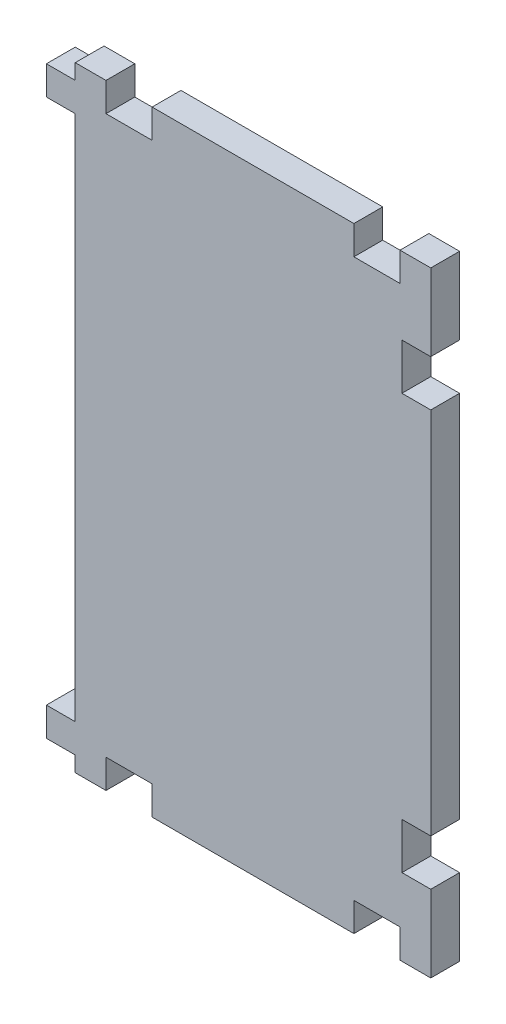
ISO-10303-21;
HEADER;
FILE_DESCRIPTION(('STEP AP214'),'2;1');
FILE_NAME('part.step','',(''),(''),'','','');
FILE_SCHEMA(('AUTOMOTIVE_DESIGN { 1 0 10303 214 1 1 1 1 }'));
ENDSEC;
DATA;
#1=APPLICATION_CONTEXT('core data for automotive mechanical design processes');
#2=APPLICATION_PROTOCOL_DEFINITION('international standard','automotive_design',2000,#1);
#3=PRODUCT_CONTEXT('',#1,'mechanical');
#4=PRODUCT('Part','Part','',(#3));
#5=PRODUCT_RELATED_PRODUCT_CATEGORY('part','',(#4));
#6=PRODUCT_DEFINITION_FORMATION('','',#4);
#7=PRODUCT_DEFINITION_CONTEXT('part definition',#1,'design');
#8=PRODUCT_DEFINITION('design','',#6,#7);
#9=PRODUCT_DEFINITION_SHAPE('','',#8);
#10=(LENGTH_UNIT() NAMED_UNIT(*) SI_UNIT(.MILLI.,.METRE.));
#11=(NAMED_UNIT(*) PLANE_ANGLE_UNIT() SI_UNIT($,.RADIAN.));
#12=(NAMED_UNIT(*) SI_UNIT($,.STERADIAN.) SOLID_ANGLE_UNIT());
#13=UNCERTAINTY_MEASURE_WITH_UNIT(LENGTH_MEASURE(1.E-05),#10,'distance_accuracy_value','');
#14=(GEOMETRIC_REPRESENTATION_CONTEXT(3) GLOBAL_UNCERTAINTY_ASSIGNED_CONTEXT((#13)) GLOBAL_UNIT_ASSIGNED_CONTEXT((#10,
#11,#12)) REPRESENTATION_CONTEXT('',''));
#15=CARTESIAN_POINT('',(0.,0.,0.));
#16=DIRECTION('',(0.,0.,1.));
#17=DIRECTION('',(1.,0.,0.));
#18=AXIS2_PLACEMENT_3D('',#15,#16,#17);
#19=CARTESIAN_POINT('',(-4.7625,0.,4.7625));
#20=DIRECTION('',(1.,0.,0.));
#21=DIRECTION('',(0.,0.,-1.));
#22=AXIS2_PLACEMENT_3D('',#19,#20,#21);
#23=PLANE('',#22);
#24=DIRECTION('',(0.,-1.,0.));
#25=VECTOR('',#24,1.);
#26=CARTESIAN_POINT('',(-4.7625,0.,0.));
#27=LINE('',#26,#25);
#28=CARTESIAN_POINT('',(-4.7625,-94.2975,0.));
#29=VERTEX_POINT('',#28);
#30=CARTESIAN_POINT('',(-4.7625,-99.06,0.));
#31=VERTEX_POINT('',#30);
#32=EDGE_CURVE('E408',#29,#31,#27,.T.);
#33=ORIENTED_EDGE('',*,*,#32,.T.);
#34=DIRECTION('',(0.,0.,-1.));
#35=VECTOR('',#34,1.);
#36=CARTESIAN_POINT('',(-4.7625,-99.06,4.7625));
#37=LINE('',#36,#35);
#38=CARTESIAN_POINT('',(-4.7625,-99.06,4.7625));
#39=VERTEX_POINT('',#38);
#40=EDGE_CURVE('E11',#39,#31,#37,.T.);
#41=ORIENTED_EDGE('',*,*,#40,.F.);
#42=DIRECTION('',(0.,-1.,0.));
#43=VECTOR('',#42,1.);
#44=CARTESIAN_POINT('',(-4.7625,0.,4.7625));
#45=LINE('',#44,#43);
#46=CARTESIAN_POINT('',(-4.7625,-94.2975,4.7625));
#47=VERTEX_POINT('',#46);
#48=EDGE_CURVE('E310',#47,#39,#45,.T.);
#49=ORIENTED_EDGE('',*,*,#48,.F.);
#50=DIRECTION('',(0.,0.,-1.));
#51=VECTOR('',#50,1.);
#52=CARTESIAN_POINT('',(-4.7625,-94.2975,4.7625));
#53=LINE('',#52,#51);
#54=EDGE_CURVE('E51',#47,#29,#53,.T.);
#55=ORIENTED_EDGE('',*,*,#54,.T.);
#56=EDGE_LOOP('',(#33,#41,#49,#55));
#57=FACE_BOUND('',#56,.T.);
#58=ADVANCED_FACE('F35',(#57),#23,.F.);
#59=CARTESIAN_POINT('',(0.,-99.06,4.7625));
#60=DIRECTION('',(0.,1.,0.));
#61=DIRECTION('',(0.,0.,1.));
#62=AXIS2_PLACEMENT_3D('',#59,#60,#61);
#63=PLANE('',#62);
#64=DIRECTION('',(1.,0.,0.));
#65=VECTOR('',#64,1.);
#66=CARTESIAN_POINT('',(0.,-99.06,0.));
#67=LINE('',#66,#65);
#68=CARTESIAN_POINT('',(0.,-99.06,0.));
#69=VERTEX_POINT('',#68);
#70=EDGE_CURVE('E401',#31,#69,#67,.T.);
#71=ORIENTED_EDGE('',*,*,#70,.T.);
#72=DIRECTION('',(0.,0.,-1.));
#73=VECTOR('',#72,1.);
#74=CARTESIAN_POINT('',(0.,-99.06,4.7625));
#75=LINE('',#74,#73);
#76=CARTESIAN_POINT('',(0.,-99.06,4.7625));
#77=VERTEX_POINT('',#76);
#78=EDGE_CURVE('E43',#77,#69,#75,.T.);
#79=ORIENTED_EDGE('',*,*,#78,.F.);
#80=DIRECTION('',(1.,0.,0.));
#81=VECTOR('',#80,1.);
#82=CARTESIAN_POINT('',(0.,-99.06,4.7625));
#83=LINE('',#82,#81);
#84=EDGE_CURVE('E174',#39,#77,#83,.T.);
#85=ORIENTED_EDGE('',*,*,#84,.F.);
#86=ORIENTED_EDGE('',*,*,#40,.T.);
#87=EDGE_LOOP('',(#71,#79,#85,#86));
#88=FACE_BOUND('',#87,.T.);
#89=ADVANCED_FACE('F552',(#88),#63,.F.);
#90=CARTESIAN_POINT('',(0.,0.,4.7625));
#91=DIRECTION('',(1.,0.,0.));
#92=DIRECTION('',(0.,0.,-1.));
#93=AXIS2_PLACEMENT_3D('',#90,#91,#92);
#94=PLANE('',#93);
#95=DIRECTION('',(0.,-1.,0.));
#96=VECTOR('',#95,1.);
#97=CARTESIAN_POINT('',(0.,0.,0.));
#98=LINE('',#97,#96);
#99=CARTESIAN_POINT('',(0.,-101.6,0.));
#100=VERTEX_POINT('',#99);
#101=EDGE_CURVE('E320',#69,#100,#98,.T.);
#102=ORIENTED_EDGE('',*,*,#101,.T.);
#103=DIRECTION('',(0.,0.,-1.));
#104=VECTOR('',#103,1.);
#105=CARTESIAN_POINT('',(0.,-101.6,4.7625));
#106=LINE('',#105,#104);
#107=CARTESIAN_POINT('',(0.,-101.6,4.7625));
#108=VERTEX_POINT('',#107);
#109=EDGE_CURVE('E393',#108,#100,#106,.T.);
#110=ORIENTED_EDGE('',*,*,#109,.F.);
#111=DIRECTION('',(0.,-1.,0.));
#112=VECTOR('',#111,1.);
#113=CARTESIAN_POINT('',(0.,0.,4.7625));
#114=LINE('',#113,#112);
#115=EDGE_CURVE('E298',#77,#108,#114,.T.);
#116=ORIENTED_EDGE('',*,*,#115,.F.);
#117=ORIENTED_EDGE('',*,*,#78,.T.);
#118=EDGE_LOOP('',(#102,#110,#116,#117));
#119=FACE_BOUND('',#118,.T.);
#120=ADVANCED_FACE('F398',(#119),#94,.F.);
#121=CARTESIAN_POINT('',(0.,-101.6,4.7625));
#122=DIRECTION('',(0.,1.,0.));
#123=DIRECTION('',(0.,0.,1.));
#124=AXIS2_PLACEMENT_3D('',#121,#122,#123);
#125=PLANE('',#124);
#126=DIRECTION('',(1.,0.,0.));
#127=VECTOR('',#126,1.);
#128=CARTESIAN_POINT('',(0.,-101.6,0.));
#129=LINE('',#128,#127);
#130=CARTESIAN_POINT('',(5.08000000000001,-101.6,0.));
#131=VERTEX_POINT('',#130);
#132=EDGE_CURVE('E403',#100,#131,#129,.T.);
#133=ORIENTED_EDGE('',*,*,#132,.T.);
#134=DIRECTION('',(0.,0.,-1.));
#135=VECTOR('',#134,1.);
#136=CARTESIAN_POINT('',(5.08000000000001,-101.6,4.7625));
#137=LINE('',#136,#135);
#138=CARTESIAN_POINT('',(5.08000000000001,-101.6,4.7625));
#139=VERTEX_POINT('',#138);
#140=EDGE_CURVE('E390',#139,#131,#137,.T.);
#141=ORIENTED_EDGE('',*,*,#140,.F.);
#142=DIRECTION('',(1.,0.,0.));
#143=VECTOR('',#142,1.);
#144=CARTESIAN_POINT('',(0.,-101.6,4.7625));
#145=LINE('',#144,#143);
#146=EDGE_CURVE('E304',#108,#139,#145,.T.);
#147=ORIENTED_EDGE('',*,*,#146,.F.);
#148=ORIENTED_EDGE('',*,*,#109,.T.);
#149=EDGE_LOOP('',(#133,#141,#147,#148));
#150=FACE_BOUND('',#149,.T.);
#151=ADVANCED_FACE('F559',(#150),#125,.F.);
#152=CARTESIAN_POINT('',(5.08000000000001,0.,4.7625));
#153=DIRECTION('',(-1.,0.,0.));
#154=DIRECTION('',(0.,0.,1.));
#155=AXIS2_PLACEMENT_3D('',#152,#153,#154);
#156=PLANE('',#155);
#157=DIRECTION('',(0.,1.,0.));
#158=VECTOR('',#157,1.);
#159=CARTESIAN_POINT('',(5.08000000000001,0.,0.));
#160=LINE('',#159,#158);
#161=CARTESIAN_POINT('',(5.08000000000001,-96.8375,0.));
#162=VERTEX_POINT('',#161);
#163=EDGE_CURVE('E404',#131,#162,#160,.T.);
#164=ORIENTED_EDGE('',*,*,#163,.T.);
#165=DIRECTION('',(0.,0.,-1.));
#166=VECTOR('',#165,1.);
#167=CARTESIAN_POINT('',(5.08000000000001,-96.8375,4.7625));
#168=LINE('',#167,#166);
#169=CARTESIAN_POINT('',(5.08000000000001,-96.8375,4.7625));
#170=VERTEX_POINT('',#169);
#171=EDGE_CURVE('E387',#170,#162,#168,.T.);
#172=ORIENTED_EDGE('',*,*,#171,.F.);
#173=DIRECTION('',(0.,1.,0.));
#174=VECTOR('',#173,1.);
#175=CARTESIAN_POINT('',(5.08000000000001,0.,4.7625));
#176=LINE('',#175,#174);
#177=EDGE_CURVE('E307',#139,#170,#176,.T.);
#178=ORIENTED_EDGE('',*,*,#177,.F.);
#179=ORIENTED_EDGE('',*,*,#140,.T.);
#180=EDGE_LOOP('',(#164,#172,#178,#179));
#181=FACE_BOUND('',#180,.T.);
#182=ADVANCED_FACE('F561',(#181),#156,.F.);
#183=CARTESIAN_POINT('',(0.,-96.8375,4.7625));
#184=DIRECTION('',(0.,1.,0.));
#185=DIRECTION('',(0.,0.,1.));
#186=AXIS2_PLACEMENT_3D('',#183,#184,#185);
#187=PLANE('',#186);
#188=DIRECTION('',(1.,0.,0.));
#189=VECTOR('',#188,1.);
#190=CARTESIAN_POINT('',(0.,-96.8375,0.));
#191=LINE('',#190,#189);
#192=CARTESIAN_POINT('',(12.7,-96.8375,0.));
#193=VERTEX_POINT('',#192);
#194=EDGE_CURVE('E471',#162,#193,#191,.T.);
#195=ORIENTED_EDGE('',*,*,#194,.T.);
#196=DIRECTION('',(0.,0.,-1.));
#197=VECTOR('',#196,1.);
#198=CARTESIAN_POINT('',(12.7,-96.8375,4.7625));
#199=LINE('',#198,#197);
#200=CARTESIAN_POINT('',(12.7,-96.8375,4.7625));
#201=VERTEX_POINT('',#200);
#202=EDGE_CURVE('E385',#201,#193,#199,.T.);
#203=ORIENTED_EDGE('',*,*,#202,.F.);
#204=DIRECTION('',(1.,0.,0.));
#205=VECTOR('',#204,1.);
#206=CARTESIAN_POINT('',(0.,-96.8375,4.7625));
#207=LINE('',#206,#205);
#208=EDGE_CURVE('E939',#170,#201,#207,.T.);
#209=ORIENTED_EDGE('',*,*,#208,.F.);
#210=ORIENTED_EDGE('',*,*,#171,.T.);
#211=EDGE_LOOP('',(#195,#203,#209,#210));
#212=FACE_BOUND('',#211,.T.);
#213=ADVANCED_FACE('F564',(#212),#187,.F.);
#214=CARTESIAN_POINT('',(12.7,0.,4.7625));
#215=DIRECTION('',(-1.,0.,0.));
#216=DIRECTION('',(0.,-1.,0.));
#217=AXIS2_PLACEMENT_3D('',#214,#215,#216);
#218=PLANE('',#217);
#219=DIRECTION('',(0.,1.,0.));
#220=VECTOR('',#219,1.);
#221=CARTESIAN_POINT('',(12.7,0.,0.));
#222=LINE('',#221,#220);
#223=CARTESIAN_POINT('',(12.7,-101.6,0.));
#224=VERTEX_POINT('',#223);
#225=EDGE_CURVE('E465',#224,#193,#222,.T.);
#226=ORIENTED_EDGE('',*,*,#225,.F.);
#227=DIRECTION('',(0.,0.,-1.));
#228=VECTOR('',#227,1.);
#229=CARTESIAN_POINT('',(12.7,-101.6,4.7625));
#230=LINE('',#229,#228);
#231=CARTESIAN_POINT('',(12.7,-101.6,4.7625));
#232=VERTEX_POINT('',#231);
#233=EDGE_CURVE('E383',#232,#224,#230,.T.);
#234=ORIENTED_EDGE('',*,*,#233,.F.);
#235=DIRECTION('',(0.,1.,0.));
#236=VECTOR('',#235,1.);
#237=CARTESIAN_POINT('',(12.7,0.,4.7625));
#238=LINE('',#237,#236);
#239=EDGE_CURVE('E941',#232,#201,#238,.T.);
#240=ORIENTED_EDGE('',*,*,#239,.T.);
#241=ORIENTED_EDGE('',*,*,#202,.T.);
#242=EDGE_LOOP('',(#226,#234,#240,#241));
#243=FACE_BOUND('',#242,.T.);
#244=ADVANCED_FACE('F568',(#243),#218,.T.);
#245=CARTESIAN_POINT('',(46.0375,-101.6,0.));
#246=VERTEX_POINT('',#245);
#247=EDGE_CURVE('E407',#224,#246,#129,.T.);
#248=ORIENTED_EDGE('',*,*,#247,.T.);
#249=DIRECTION('',(0.,0.,-1.));
#250=VECTOR('',#249,1.);
#251=CARTESIAN_POINT('',(46.0375,-101.6,4.7625));
#252=LINE('',#251,#250);
#253=CARTESIAN_POINT('',(46.0375,-101.6,4.7625));
#254=VERTEX_POINT('',#253);
#255=EDGE_CURVE('E380',#254,#246,#252,.T.);
#256=ORIENTED_EDGE('',*,*,#255,.F.);
#257=EDGE_CURVE('E309',#232,#254,#145,.T.);
#258=ORIENTED_EDGE('',*,*,#257,.F.);
#259=ORIENTED_EDGE('',*,*,#233,.T.);
#260=EDGE_LOOP('',(#248,#256,#258,#259));
#261=FACE_BOUND('',#260,.T.);
#262=ADVANCED_FACE('F572',(#261),#125,.F.);
#263=CARTESIAN_POINT('',(46.0375,0.,4.7625));
#264=DIRECTION('',(-1.,0.,0.));
#265=DIRECTION('',(0.,0.,1.));
#266=AXIS2_PLACEMENT_3D('',#263,#264,#265);
#267=PLANE('',#266);
#268=DIRECTION('',(0.,1.,0.));
#269=VECTOR('',#268,1.);
#270=CARTESIAN_POINT('',(46.0375,0.,0.));
#271=LINE('',#270,#269);
#272=CARTESIAN_POINT('',(46.0375,-96.8375,0.));
#273=VERTEX_POINT('',#272);
#274=EDGE_CURVE('E464',#246,#273,#271,.T.);
#275=ORIENTED_EDGE('',*,*,#274,.T.);
#276=DIRECTION('',(0.,0.,-1.));
#277=VECTOR('',#276,1.);
#278=CARTESIAN_POINT('',(46.0375,-96.8375,4.7625));
#279=LINE('',#278,#277);
#280=CARTESIAN_POINT('',(46.0375,-96.8375,4.7625));
#281=VERTEX_POINT('',#280);
#282=EDGE_CURVE('E377',#281,#273,#279,.T.);
#283=ORIENTED_EDGE('',*,*,#282,.F.);
#284=DIRECTION('',(0.,1.,0.));
#285=VECTOR('',#284,1.);
#286=CARTESIAN_POINT('',(46.0375,0.,4.7625));
#287=LINE('',#286,#285);
#288=EDGE_CURVE('E496',#254,#281,#287,.T.);
#289=ORIENTED_EDGE('',*,*,#288,.F.);
#290=ORIENTED_EDGE('',*,*,#255,.T.);
#291=EDGE_LOOP('',(#275,#283,#289,#290));
#292=FACE_BOUND('',#291,.T.);
#293=ADVANCED_FACE('F574',(#292),#267,.F.);
#294=CARTESIAN_POINT('',(0.,-96.8375,4.7625));
#295=DIRECTION('',(0.,1.,0.));
#296=DIRECTION('',(0.,0.,1.));
#297=AXIS2_PLACEMENT_3D('',#294,#295,#296);
#298=PLANE('',#297);
#299=DIRECTION('',(1.,0.,0.));
#300=VECTOR('',#299,1.);
#301=CARTESIAN_POINT('',(0.,-96.8375,0.));
#302=LINE('',#301,#300);
#303=CARTESIAN_POINT('',(53.6575,-96.8375,0.));
#304=VERTEX_POINT('',#303);
#305=EDGE_CURVE('E462',#273,#304,#302,.T.);
#306=ORIENTED_EDGE('',*,*,#305,.T.);
#307=DIRECTION('',(0.,0.,-1.));
#308=VECTOR('',#307,1.);
#309=CARTESIAN_POINT('',(53.6575,-96.8375,4.7625));
#310=LINE('',#309,#308);
#311=CARTESIAN_POINT('',(53.6575,-96.8375,4.7625));
#312=VERTEX_POINT('',#311);
#313=EDGE_CURVE('E375',#312,#304,#310,.T.);
#314=ORIENTED_EDGE('',*,*,#313,.F.);
#315=DIRECTION('',(1.,0.,0.));
#316=VECTOR('',#315,1.);
#317=CARTESIAN_POINT('',(0.,-96.8375,4.7625));
#318=LINE('',#317,#316);
#319=EDGE_CURVE('E493',#281,#312,#318,.T.);
#320=ORIENTED_EDGE('',*,*,#319,.F.);
#321=ORIENTED_EDGE('',*,*,#282,.T.);
#322=EDGE_LOOP('',(#306,#314,#320,#321));
#323=FACE_BOUND('',#322,.T.);
#324=ADVANCED_FACE('F482',(#323),#298,.F.);
#325=CARTESIAN_POINT('',(53.6575,0.,4.7625));
#326=DIRECTION('',(-1.,0.,0.));
#327=DIRECTION('',(0.,0.,1.));
#328=AXIS2_PLACEMENT_3D('',#325,#326,#327);
#329=PLANE('',#328);
#330=DIRECTION('',(0.,1.,0.));
#331=VECTOR('',#330,1.);
#332=CARTESIAN_POINT('',(53.6575,0.,0.));
#333=LINE('',#332,#331);
#334=CARTESIAN_POINT('',(53.6575,-101.6,0.));
#335=VERTEX_POINT('',#334);
#336=EDGE_CURVE('E458',#335,#304,#333,.T.);
#337=ORIENTED_EDGE('',*,*,#336,.F.);
#338=DIRECTION('',(0.,0.,-1.));
#339=VECTOR('',#338,1.);
#340=CARTESIAN_POINT('',(53.6575,-101.6,4.7625));
#341=LINE('',#340,#339);
#342=CARTESIAN_POINT('',(53.6575,-101.6,4.7625));
#343=VERTEX_POINT('',#342);
#344=EDGE_CURVE('E373',#343,#335,#341,.T.);
#345=ORIENTED_EDGE('',*,*,#344,.F.);
#346=DIRECTION('',(0.,1.,0.));
#347=VECTOR('',#346,1.);
#348=CARTESIAN_POINT('',(53.6575,0.,4.7625));
#349=LINE('',#348,#347);
#350=EDGE_CURVE('E492',#343,#312,#349,.T.);
#351=ORIENTED_EDGE('',*,*,#350,.T.);
#352=ORIENTED_EDGE('',*,*,#313,.T.);
#353=EDGE_LOOP('',(#337,#345,#351,#352));
#354=FACE_BOUND('',#353,.T.);
#355=ADVANCED_FACE('F489',(#354),#329,.T.);
#356=CARTESIAN_POINT('',(58.7375,-101.6,0.));
#357=VERTEX_POINT('',#356);
#358=EDGE_CURVE('E406',#335,#357,#129,.T.);
#359=ORIENTED_EDGE('',*,*,#358,.T.);
#360=DIRECTION('',(0.,0.,-1.));
#361=VECTOR('',#360,1.);
#362=CARTESIAN_POINT('',(58.7375,-101.6,4.7625));
#363=LINE('',#362,#361);
#364=CARTESIAN_POINT('',(58.7375,-101.6,4.7625));
#365=VERTEX_POINT('',#364);
#366=EDGE_CURVE('E371',#365,#357,#363,.T.);
#367=ORIENTED_EDGE('',*,*,#366,.F.);
#368=EDGE_CURVE('E308',#343,#365,#145,.T.);
#369=ORIENTED_EDGE('',*,*,#368,.F.);
#370=ORIENTED_EDGE('',*,*,#344,.T.);
#371=EDGE_LOOP('',(#359,#367,#369,#370));
#372=FACE_BOUND('',#371,.T.);
#373=ADVANCED_FACE('F582',(#372),#125,.F.);
#374=CARTESIAN_POINT('',(58.7375,0.,4.7625));
#375=DIRECTION('',(1.,0.,0.));
#376=DIRECTION('',(0.,1.,0.));
#377=AXIS2_PLACEMENT_3D('',#374,#375,#376);
#378=PLANE('',#377);
#379=DIRECTION('',(0.,-1.,0.));
#380=VECTOR('',#379,1.);
#381=CARTESIAN_POINT('',(58.7375,0.,0.));
#382=LINE('',#381,#380);
#383=CARTESIAN_POINT('',(58.7375,-88.9,0.));
#384=VERTEX_POINT('',#383);
#385=EDGE_CURVE('E442',#384,#357,#382,.T.);
#386=ORIENTED_EDGE('',*,*,#385,.F.);
#387=DIRECTION('',(0.,0.,-1.));
#388=VECTOR('',#387,1.);
#389=CARTESIAN_POINT('',(58.7375,-88.9,4.7625));
#390=LINE('',#389,#388);
#391=CARTESIAN_POINT('',(58.7375,-88.9,4.7625));
#392=VERTEX_POINT('',#391);
#393=EDGE_CURVE('E369',#392,#384,#390,.T.);
#394=ORIENTED_EDGE('',*,*,#393,.F.);
#395=DIRECTION('',(0.,-1.,0.));
#396=VECTOR('',#395,1.);
#397=CARTESIAN_POINT('',(58.7375,0.,4.7625));
#398=LINE('',#397,#396);
#399=EDGE_CURVE('E495',#392,#365,#398,.T.);
#400=ORIENTED_EDGE('',*,*,#399,.T.);
#401=ORIENTED_EDGE('',*,*,#366,.T.);
#402=EDGE_LOOP('',(#386,#394,#400,#401));
#403=FACE_BOUND('',#402,.T.);
#404=ADVANCED_FACE('F585',(#403),#378,.T.);
#405=CARTESIAN_POINT('',(0.,-88.9,4.7625));
#406=DIRECTION('',(0.,-1.,0.));
#407=DIRECTION('',(0.,0.,-1.));
#408=AXIS2_PLACEMENT_3D('',#405,#406,#407);
#409=PLANE('',#408);
#410=DIRECTION('',(-1.,0.,0.));
#411=VECTOR('',#410,1.);
#412=CARTESIAN_POINT('',(0.,-88.9,0.));
#413=LINE('',#412,#411);
#414=CARTESIAN_POINT('',(53.975,-88.9,0.));
#415=VERTEX_POINT('',#414);
#416=EDGE_CURVE('E452',#384,#415,#413,.T.);
#417=ORIENTED_EDGE('',*,*,#416,.T.);
#418=DIRECTION('',(0.,0.,-1.));
#419=VECTOR('',#418,1.);
#420=CARTESIAN_POINT('',(53.975,-88.9,4.7625));
#421=LINE('',#420,#419);
#422=CARTESIAN_POINT('',(53.975,-88.9,4.7625));
#423=VERTEX_POINT('',#422);
#424=EDGE_CURVE('E366',#423,#415,#421,.T.);
#425=ORIENTED_EDGE('',*,*,#424,.F.);
#426=DIRECTION('',(-1.,0.,0.));
#427=VECTOR('',#426,1.);
#428=CARTESIAN_POINT('',(0.,-88.9,4.7625));
#429=LINE('',#428,#427);
#430=EDGE_CURVE('E502',#392,#423,#429,.T.);
#431=ORIENTED_EDGE('',*,*,#430,.F.);
#432=ORIENTED_EDGE('',*,*,#393,.T.);
#433=EDGE_LOOP('',(#417,#425,#431,#432));
#434=FACE_BOUND('',#433,.T.);
#435=ADVANCED_FACE('F586',(#434),#409,.F.);
#436=CARTESIAN_POINT('',(53.9749999999999,0.,4.7625));
#437=DIRECTION('',(-1.,0.,0.));
#438=DIRECTION('',(0.,-1.,0.));
#439=AXIS2_PLACEMENT_3D('',#436,#437,#438);
#440=PLANE('',#439);
#441=DIRECTION('',(0.,1.,0.));
#442=VECTOR('',#441,1.);
#443=CARTESIAN_POINT('',(53.9749999999999,0.,0.));
#444=LINE('',#443,#442);
#445=CARTESIAN_POINT('',(53.975,-81.28,0.));
#446=VERTEX_POINT('',#445);
#447=EDGE_CURVE('E456',#415,#446,#444,.T.);
#448=ORIENTED_EDGE('',*,*,#447,.T.);
#449=DIRECTION('',(0.,0.,-1.));
#450=VECTOR('',#449,1.);
#451=CARTESIAN_POINT('',(53.975,-81.28,4.7625));
#452=LINE('',#451,#450);
#453=CARTESIAN_POINT('',(53.975,-81.28,4.7625));
#454=VERTEX_POINT('',#453);
#455=EDGE_CURVE('E364',#454,#446,#452,.T.);
#456=ORIENTED_EDGE('',*,*,#455,.F.);
#457=DIRECTION('',(0.,1.,0.));
#458=VECTOR('',#457,1.);
#459=CARTESIAN_POINT('',(53.9749999999999,0.,4.7625));
#460=LINE('',#459,#458);
#461=EDGE_CURVE('E506',#423,#454,#460,.T.);
#462=ORIENTED_EDGE('',*,*,#461,.F.);
#463=ORIENTED_EDGE('',*,*,#424,.T.);
#464=EDGE_LOOP('',(#448,#456,#462,#463));
#465=FACE_BOUND('',#464,.T.);
#466=ADVANCED_FACE('F589',(#465),#440,.F.);
#467=CARTESIAN_POINT('',(0.,-81.28,4.7625));
#468=DIRECTION('',(0.,-1.,0.));
#469=DIRECTION('',(0.,0.,-1.));
#470=AXIS2_PLACEMENT_3D('',#467,#468,#469);
#471=PLANE('',#470);
#472=DIRECTION('',(-1.,0.,0.));
#473=VECTOR('',#472,1.);
#474=CARTESIAN_POINT('',(0.,-81.28,0.));
#475=LINE('',#474,#473);
#476=CARTESIAN_POINT('',(58.7375,-81.28,0.));
#477=VERTEX_POINT('',#476);
#478=EDGE_CURVE('E450',#477,#446,#475,.T.);
#479=ORIENTED_EDGE('',*,*,#478,.F.);
#480=DIRECTION('',(0.,0.,-1.));
#481=VECTOR('',#480,1.);
#482=CARTESIAN_POINT('',(58.7375,-81.28,4.7625));
#483=LINE('',#482,#481);
#484=CARTESIAN_POINT('',(58.7375,-81.28,4.7625));
#485=VERTEX_POINT('',#484);
#486=EDGE_CURVE('E362',#485,#477,#483,.T.);
#487=ORIENTED_EDGE('',*,*,#486,.F.);
#488=DIRECTION('',(-1.,0.,0.));
#489=VECTOR('',#488,1.);
#490=CARTESIAN_POINT('',(0.,-81.28,4.7625));
#491=LINE('',#490,#489);
#492=EDGE_CURVE('E508',#485,#454,#491,.T.);
#493=ORIENTED_EDGE('',*,*,#492,.T.);
#494=ORIENTED_EDGE('',*,*,#455,.T.);
#495=EDGE_LOOP('',(#479,#487,#493,#494));
#496=FACE_BOUND('',#495,.T.);
#497=ADVANCED_FACE('F593',(#496),#471,.T.);
#498=CARTESIAN_POINT('',(58.7375,-20.32,0.));
#499=VERTEX_POINT('',#498);
#500=EDGE_CURVE('E441',#499,#477,#382,.T.);
#501=ORIENTED_EDGE('',*,*,#500,.F.);
#502=DIRECTION('',(0.,0.,-1.));
#503=VECTOR('',#502,1.);
#504=CARTESIAN_POINT('',(58.7375,-20.32,4.7625));
#505=LINE('',#504,#503);
#506=CARTESIAN_POINT('',(58.7375,-20.32,4.7625));
#507=VERTEX_POINT('',#506);
#508=EDGE_CURVE('E360',#507,#499,#505,.T.);
#509=ORIENTED_EDGE('',*,*,#508,.F.);
#510=EDGE_CURVE('E504',#507,#485,#398,.T.);
#511=ORIENTED_EDGE('',*,*,#510,.T.);
#512=ORIENTED_EDGE('',*,*,#486,.T.);
#513=EDGE_LOOP('',(#501,#509,#511,#512));
#514=FACE_BOUND('',#513,.T.);
#515=ADVANCED_FACE('F597',(#514),#378,.T.);
#516=CARTESIAN_POINT('',(0.,-20.32,4.7625));
#517=DIRECTION('',(0.,-1.,0.));
#518=DIRECTION('',(0.,0.,-1.));
#519=AXIS2_PLACEMENT_3D('',#516,#517,#518);
#520=PLANE('',#519);
#521=DIRECTION('',(-1.,0.,0.));
#522=VECTOR('',#521,1.);
#523=CARTESIAN_POINT('',(0.,-20.32,0.));
#524=LINE('',#523,#522);
#525=CARTESIAN_POINT('',(53.975,-20.32,0.));
#526=VERTEX_POINT('',#525);
#527=EDGE_CURVE('E449',#499,#526,#524,.T.);
#528=ORIENTED_EDGE('',*,*,#527,.T.);
#529=DIRECTION('',(0.,0.,-1.));
#530=VECTOR('',#529,1.);
#531=CARTESIAN_POINT('',(53.975,-20.32,4.7625));
#532=LINE('',#531,#530);
#533=CARTESIAN_POINT('',(53.975,-20.32,4.7625));
#534=VERTEX_POINT('',#533);
#535=EDGE_CURVE('E357',#534,#526,#532,.T.);
#536=ORIENTED_EDGE('',*,*,#535,.F.);
#537=DIRECTION('',(-1.,0.,0.));
#538=VECTOR('',#537,1.);
#539=CARTESIAN_POINT('',(0.,-20.32,4.7625));
#540=LINE('',#539,#538);
#541=EDGE_CURVE('E511',#507,#534,#540,.T.);
#542=ORIENTED_EDGE('',*,*,#541,.F.);
#543=ORIENTED_EDGE('',*,*,#508,.T.);
#544=EDGE_LOOP('',(#528,#536,#542,#543));
#545=FACE_BOUND('',#544,.T.);
#546=ADVANCED_FACE('F599',(#545),#520,.F.);
#547=CARTESIAN_POINT('',(53.975,0.,4.7625));
#548=DIRECTION('',(-1.,0.,0.));
#549=DIRECTION('',(0.,0.,1.));
#550=AXIS2_PLACEMENT_3D('',#547,#548,#549);
#551=PLANE('',#550);
#552=DIRECTION('',(0.,1.,0.));
#553=VECTOR('',#552,1.);
#554=CARTESIAN_POINT('',(53.975,0.,0.));
#555=LINE('',#554,#553);
#556=CARTESIAN_POINT('',(53.975,-12.7,0.));
#557=VERTEX_POINT('',#556);
#558=EDGE_CURVE('E445',#526,#557,#555,.T.);
#559=ORIENTED_EDGE('',*,*,#558,.T.);
#560=DIRECTION('',(0.,0.,-1.));
#561=VECTOR('',#560,1.);
#562=CARTESIAN_POINT('',(53.975,-12.7,4.7625));
#563=LINE('',#562,#561);
#564=CARTESIAN_POINT('',(53.975,-12.7,4.7625));
#565=VERTEX_POINT('',#564);
#566=EDGE_CURVE('E355',#565,#557,#563,.T.);
#567=ORIENTED_EDGE('',*,*,#566,.F.);
#568=DIRECTION('',(0.,1.,0.));
#569=VECTOR('',#568,1.);
#570=CARTESIAN_POINT('',(53.975,0.,4.7625));
#571=LINE('',#570,#569);
#572=EDGE_CURVE('E513',#534,#565,#571,.T.);
#573=ORIENTED_EDGE('',*,*,#572,.F.);
#574=ORIENTED_EDGE('',*,*,#535,.T.);
#575=EDGE_LOOP('',(#559,#567,#573,#574));
#576=FACE_BOUND('',#575,.T.);
#577=ADVANCED_FACE('F602',(#576),#551,.F.);
#578=CARTESIAN_POINT('',(0.,-12.7,4.7625));
#579=DIRECTION('',(0.,-1.,0.));
#580=DIRECTION('',(0.,0.,-1.));
#581=AXIS2_PLACEMENT_3D('',#578,#579,#580);
#582=PLANE('',#581);
#583=DIRECTION('',(-1.,0.,0.));
#584=VECTOR('',#583,1.);
#585=CARTESIAN_POINT('',(0.,-12.7,0.));
#586=LINE('',#585,#584);
#587=CARTESIAN_POINT('',(58.7375,-12.7,0.));
#588=VERTEX_POINT('',#587);
#589=EDGE_CURVE('E439',#588,#557,#586,.T.);
#590=ORIENTED_EDGE('',*,*,#589,.F.);
#591=DIRECTION('',(0.,0.,-1.));
#592=VECTOR('',#591,1.);
#593=CARTESIAN_POINT('',(58.7375,-12.7,4.7625));
#594=LINE('',#593,#592);
#595=CARTESIAN_POINT('',(58.7375,-12.7,4.7625));
#596=VERTEX_POINT('',#595);
#597=EDGE_CURVE('E353',#596,#588,#594,.T.);
#598=ORIENTED_EDGE('',*,*,#597,.F.);
#599=DIRECTION('',(-1.,0.,0.));
#600=VECTOR('',#599,1.);
#601=CARTESIAN_POINT('',(0.,-12.7,4.7625));
#602=LINE('',#601,#600);
#603=EDGE_CURVE('E515',#596,#565,#602,.T.);
#604=ORIENTED_EDGE('',*,*,#603,.T.);
#605=ORIENTED_EDGE('',*,*,#566,.T.);
#606=EDGE_LOOP('',(#590,#598,#604,#605));
#607=FACE_BOUND('',#606,.T.);
#608=ADVANCED_FACE('F606',(#607),#582,.T.);
#609=CARTESIAN_POINT('',(58.7375,0.,0.));
#610=VERTEX_POINT('',#609);
#611=EDGE_CURVE('E433',#610,#588,#382,.T.);
#612=ORIENTED_EDGE('',*,*,#611,.F.);
#613=DIRECTION('',(0.,0.,-1.));
#614=VECTOR('',#613,1.);
#615=CARTESIAN_POINT('',(58.7375,0.,4.7625));
#616=LINE('',#615,#614);
#617=CARTESIAN_POINT('',(58.7375,0.,4.7625));
#618=VERTEX_POINT('',#617);
#619=EDGE_CURVE('E351',#618,#610,#616,.T.);
#620=ORIENTED_EDGE('',*,*,#619,.F.);
#621=EDGE_CURVE('E503',#618,#596,#398,.T.);
#622=ORIENTED_EDGE('',*,*,#621,.T.);
#623=ORIENTED_EDGE('',*,*,#597,.T.);
#624=EDGE_LOOP('',(#612,#620,#622,#623));
#625=FACE_BOUND('',#624,.T.);
#626=ADVANCED_FACE('F610',(#625),#378,.T.);
#627=CARTESIAN_POINT('',(0.,0.,4.7625));
#628=DIRECTION('',(0.,1.,0.));
#629=DIRECTION('',(0.,0.,1.));
#630=AXIS2_PLACEMENT_3D('',#627,#628,#629);
#631=PLANE('',#630);
#632=DIRECTION('',(1.,0.,0.));
#633=VECTOR('',#632,1.);
#634=CARTESIAN_POINT('',(0.,0.,0.));
#635=LINE('',#634,#633);
#636=CARTESIAN_POINT('',(53.6575,0.,0.));
#637=VERTEX_POINT('',#636);
#638=EDGE_CURVE('E421',#637,#610,#635,.T.);
#639=ORIENTED_EDGE('',*,*,#638,.F.);
#640=DIRECTION('',(0.,0.,-1.));
#641=VECTOR('',#640,1.);
#642=CARTESIAN_POINT('',(53.6575,0.,4.7625));
#643=LINE('',#642,#641);
#644=CARTESIAN_POINT('',(53.6575,0.,4.7625));
#645=VERTEX_POINT('',#644);
#646=EDGE_CURVE('E349',#645,#637,#643,.T.);
#647=ORIENTED_EDGE('',*,*,#646,.F.);
#648=DIRECTION('',(1.,0.,0.));
#649=VECTOR('',#648,1.);
#650=CARTESIAN_POINT('',(0.,0.,4.7625));
#651=LINE('',#650,#649);
#652=EDGE_CURVE('E518',#645,#618,#651,.T.);
#653=ORIENTED_EDGE('',*,*,#652,.T.);
#654=ORIENTED_EDGE('',*,*,#619,.T.);
#655=EDGE_LOOP('',(#639,#647,#653,#654));
#656=FACE_BOUND('',#655,.T.);
#657=ADVANCED_FACE('F614',(#656),#631,.T.);
#658=CARTESIAN_POINT('',(53.6575,0.,4.7625));
#659=DIRECTION('',(1.,0.,0.));
#660=DIRECTION('',(0.,0.,-1.));
#661=AXIS2_PLACEMENT_3D('',#658,#659,#660);
#662=PLANE('',#661);
#663=DIRECTION('',(0.,-1.,0.));
#664=VECTOR('',#663,1.);
#665=CARTESIAN_POINT('',(53.6575,0.,0.));
#666=LINE('',#665,#664);
#667=CARTESIAN_POINT('',(53.6575,-4.7625,0.));
#668=VERTEX_POINT('',#667);
#669=EDGE_CURVE('E432',#637,#668,#666,.T.);
#670=ORIENTED_EDGE('',*,*,#669,.T.);
#671=DIRECTION('',(0.,0.,-1.));
#672=VECTOR('',#671,1.);
#673=CARTESIAN_POINT('',(53.6575,-4.7625,4.7625));
#674=LINE('',#673,#672);
#675=CARTESIAN_POINT('',(53.6575,-4.7625,4.7625));
#676=VERTEX_POINT('',#675);
#677=EDGE_CURVE('E347',#676,#668,#674,.T.);
#678=ORIENTED_EDGE('',*,*,#677,.F.);
#679=DIRECTION('',(0.,-1.,0.));
#680=VECTOR('',#679,1.);
#681=CARTESIAN_POINT('',(53.6575,0.,4.7625));
#682=LINE('',#681,#680);
#683=EDGE_CURVE('E521',#645,#676,#682,.T.);
#684=ORIENTED_EDGE('',*,*,#683,.F.);
#685=ORIENTED_EDGE('',*,*,#646,.T.);
#686=EDGE_LOOP('',(#670,#678,#684,#685));
#687=FACE_BOUND('',#686,.T.);
#688=ADVANCED_FACE('F616',(#687),#662,.F.);
#689=CARTESIAN_POINT('',(0.,-4.7625,4.7625));
#690=DIRECTION('',(0.,1.,0.));
#691=DIRECTION('',(0.,0.,1.));
#692=AXIS2_PLACEMENT_3D('',#689,#690,#691);
#693=PLANE('',#692);
#694=DIRECTION('',(1.,0.,0.));
#695=VECTOR('',#694,1.);
#696=CARTESIAN_POINT('',(0.,-4.7625,0.));
#697=LINE('',#696,#695);
#698=CARTESIAN_POINT('',(46.0375,-4.7625,0.));
#699=VERTEX_POINT('',#698);
#700=EDGE_CURVE('E438',#699,#668,#697,.T.);
#701=ORIENTED_EDGE('',*,*,#700,.F.);
#702=DIRECTION('',(0.,0.,-1.));
#703=VECTOR('',#702,1.);
#704=CARTESIAN_POINT('',(46.0375,-4.7625,4.7625));
#705=LINE('',#704,#703);
#706=CARTESIAN_POINT('',(46.0375,-4.7625,4.7625));
#707=VERTEX_POINT('',#706);
#708=EDGE_CURVE('E345',#707,#699,#705,.T.);
#709=ORIENTED_EDGE('',*,*,#708,.F.);
#710=DIRECTION('',(1.,0.,0.));
#711=VECTOR('',#710,1.);
#712=CARTESIAN_POINT('',(0.,-4.7625,4.7625));
#713=LINE('',#712,#711);
#714=EDGE_CURVE('E524',#707,#676,#713,.T.);
#715=ORIENTED_EDGE('',*,*,#714,.T.);
#716=ORIENTED_EDGE('',*,*,#677,.T.);
#717=EDGE_LOOP('',(#701,#709,#715,#716));
#718=FACE_BOUND('',#717,.T.);
#719=ADVANCED_FACE('F619',(#718),#693,.T.);
#720=CARTESIAN_POINT('',(46.0375,0.,4.7625));
#721=DIRECTION('',(1.,0.,0.));
#722=DIRECTION('',(0.,0.,-1.));
#723=AXIS2_PLACEMENT_3D('',#720,#721,#722);
#724=PLANE('',#723);
#725=DIRECTION('',(0.,-1.,0.));
#726=VECTOR('',#725,1.);
#727=CARTESIAN_POINT('',(46.0375,0.,0.));
#728=LINE('',#727,#726);
#729=CARTESIAN_POINT('',(46.0375,0.,0.));
#730=VERTEX_POINT('',#729);
#731=EDGE_CURVE('E430',#730,#699,#728,.T.);
#732=ORIENTED_EDGE('',*,*,#731,.F.);
#733=DIRECTION('',(0.,0.,-1.));
#734=VECTOR('',#733,1.);
#735=CARTESIAN_POINT('',(46.0375,0.,4.7625));
#736=LINE('',#735,#734);
#737=CARTESIAN_POINT('',(46.0375,0.,4.7625));
#738=VERTEX_POINT('',#737);
#739=EDGE_CURVE('E343',#738,#730,#736,.T.);
#740=ORIENTED_EDGE('',*,*,#739,.F.);
#741=DIRECTION('',(0.,-1.,0.));
#742=VECTOR('',#741,1.);
#743=CARTESIAN_POINT('',(46.0375,0.,4.7625));
#744=LINE('',#743,#742);
#745=EDGE_CURVE('E527',#738,#707,#744,.T.);
#746=ORIENTED_EDGE('',*,*,#745,.T.);
#747=ORIENTED_EDGE('',*,*,#708,.T.);
#748=EDGE_LOOP('',(#732,#740,#746,#747));
#749=FACE_BOUND('',#748,.T.);
#750=ADVANCED_FACE('F623',(#749),#724,.T.);
#751=CARTESIAN_POINT('',(12.7,0.,0.));
#752=VERTEX_POINT('',#751);
#753=EDGE_CURVE('E420',#752,#730,#635,.T.);
#754=ORIENTED_EDGE('',*,*,#753,.F.);
#755=DIRECTION('',(0.,0.,-1.));
#756=VECTOR('',#755,1.);
#757=CARTESIAN_POINT('',(12.7,0.,4.7625));
#758=LINE('',#757,#756);
#759=CARTESIAN_POINT('',(12.7,0.,4.7625));
#760=VERTEX_POINT('',#759);
#761=EDGE_CURVE('E341',#760,#752,#758,.T.);
#762=ORIENTED_EDGE('',*,*,#761,.F.);
#763=EDGE_CURVE('E522',#760,#738,#651,.T.);
#764=ORIENTED_EDGE('',*,*,#763,.T.);
#765=ORIENTED_EDGE('',*,*,#739,.T.);
#766=EDGE_LOOP('',(#754,#762,#764,#765));
#767=FACE_BOUND('',#766,.T.);
#768=ADVANCED_FACE('F627',(#767),#631,.T.);
#769=CARTESIAN_POINT('',(12.7,0.,4.7625));
#770=DIRECTION('',(1.,0.,0.));
#771=DIRECTION('',(0.,0.,-1.));
#772=AXIS2_PLACEMENT_3D('',#769,#770,#771);
#773=PLANE('',#772);
#774=DIRECTION('',(0.,-1.,0.));
#775=VECTOR('',#774,1.);
#776=CARTESIAN_POINT('',(12.7,0.,0.));
#777=LINE('',#776,#775);
#778=CARTESIAN_POINT('',(12.7,-4.7625,0.));
#779=VERTEX_POINT('',#778);
#780=EDGE_CURVE('E429',#752,#779,#777,.T.);
#781=ORIENTED_EDGE('',*,*,#780,.T.);
#782=DIRECTION('',(0.,0.,-1.));
#783=VECTOR('',#782,1.);
#784=CARTESIAN_POINT('',(12.7,-4.7625,4.7625));
#785=LINE('',#784,#783);
#786=CARTESIAN_POINT('',(12.7,-4.7625,4.7625));
#787=VERTEX_POINT('',#786);
#788=EDGE_CURVE('E339',#787,#779,#785,.T.);
#789=ORIENTED_EDGE('',*,*,#788,.F.);
#790=DIRECTION('',(0.,-1.,0.));
#791=VECTOR('',#790,1.);
#792=CARTESIAN_POINT('',(12.7,0.,4.7625));
#793=LINE('',#792,#791);
#794=EDGE_CURVE('E530',#760,#787,#793,.T.);
#795=ORIENTED_EDGE('',*,*,#794,.F.);
#796=ORIENTED_EDGE('',*,*,#761,.T.);
#797=EDGE_LOOP('',(#781,#789,#795,#796));
#798=FACE_BOUND('',#797,.T.);
#799=ADVANCED_FACE('F629',(#798),#773,.F.);
#800=CARTESIAN_POINT('',(0.,-4.7625,4.7625));
#801=DIRECTION('',(0.,1.,0.));
#802=DIRECTION('',(0.,0.,1.));
#803=AXIS2_PLACEMENT_3D('',#800,#801,#802);
#804=PLANE('',#803);
#805=DIRECTION('',(1.,0.,0.));
#806=VECTOR('',#805,1.);
#807=CARTESIAN_POINT('',(0.,-4.7625,0.));
#808=LINE('',#807,#806);
#809=CARTESIAN_POINT('',(5.08,-4.7625,0.));
#810=VERTEX_POINT('',#809);
#811=EDGE_CURVE('E424',#810,#779,#808,.T.);
#812=ORIENTED_EDGE('',*,*,#811,.F.);
#813=DIRECTION('',(0.,0.,-1.));
#814=VECTOR('',#813,1.);
#815=CARTESIAN_POINT('',(5.08,-4.7625,4.7625));
#816=LINE('',#815,#814);
#817=CARTESIAN_POINT('',(5.08,-4.7625,4.7625));
#818=VERTEX_POINT('',#817);
#819=EDGE_CURVE('E337',#818,#810,#816,.T.);
#820=ORIENTED_EDGE('',*,*,#819,.F.);
#821=DIRECTION('',(1.,0.,0.));
#822=VECTOR('',#821,1.);
#823=CARTESIAN_POINT('',(0.,-4.7625,4.7625));
#824=LINE('',#823,#822);
#825=EDGE_CURVE('E532',#818,#787,#824,.T.);
#826=ORIENTED_EDGE('',*,*,#825,.T.);
#827=ORIENTED_EDGE('',*,*,#788,.T.);
#828=EDGE_LOOP('',(#812,#820,#826,#827));
#829=FACE_BOUND('',#828,.T.);
#830=ADVANCED_FACE('F632',(#829),#804,.T.);
#831=CARTESIAN_POINT('',(5.08,0.,4.7625));
#832=DIRECTION('',(1.,0.,0.));
#833=DIRECTION('',(0.,1.,0.));
#834=AXIS2_PLACEMENT_3D('',#831,#832,#833);
#835=PLANE('',#834);
#836=DIRECTION('',(0.,-1.,0.));
#837=VECTOR('',#836,1.);
#838=CARTESIAN_POINT('',(5.08,0.,0.));
#839=LINE('',#838,#837);
#840=CARTESIAN_POINT('',(5.08,0.,0.));
#841=VERTEX_POINT('',#840);
#842=EDGE_CURVE('E418',#841,#810,#839,.T.);
#843=ORIENTED_EDGE('',*,*,#842,.F.);
#844=DIRECTION('',(0.,0.,-1.));
#845=VECTOR('',#844,1.);
#846=CARTESIAN_POINT('',(5.08,0.,4.7625));
#847=LINE('',#846,#845);
#848=CARTESIAN_POINT('',(5.08,0.,4.7625));
#849=VERTEX_POINT('',#848);
#850=EDGE_CURVE('E335',#849,#841,#847,.T.);
#851=ORIENTED_EDGE('',*,*,#850,.F.);
#852=DIRECTION('',(0.,-1.,0.));
#853=VECTOR('',#852,1.);
#854=CARTESIAN_POINT('',(5.08,0.,4.7625));
#855=LINE('',#854,#853);
#856=EDGE_CURVE('E535',#849,#818,#855,.T.);
#857=ORIENTED_EDGE('',*,*,#856,.T.);
#858=ORIENTED_EDGE('',*,*,#819,.T.);
#859=EDGE_LOOP('',(#843,#851,#857,#858));
#860=FACE_BOUND('',#859,.T.);
#861=ADVANCED_FACE('F636',(#860),#835,.T.);
#862=CARTESIAN_POINT('',(0.,0.,0.));
#863=VERTEX_POINT('',#862);
#864=EDGE_CURVE('E411',#863,#841,#635,.T.);
#865=ORIENTED_EDGE('',*,*,#864,.F.);
#866=DIRECTION('',(0.,0.,-1.));
#867=VECTOR('',#866,1.);
#868=CARTESIAN_POINT('',(0.,0.,4.7625));
#869=LINE('',#868,#867);
#870=CARTESIAN_POINT('',(0.,0.,4.7625));
#871=VERTEX_POINT('',#870);
#872=EDGE_CURVE('E333',#871,#863,#869,.T.);
#873=ORIENTED_EDGE('',*,*,#872,.F.);
#874=EDGE_CURVE('E303',#871,#849,#651,.T.);
#875=ORIENTED_EDGE('',*,*,#874,.T.);
#876=ORIENTED_EDGE('',*,*,#850,.T.);
#877=EDGE_LOOP('',(#865,#873,#875,#876));
#878=FACE_BOUND('',#877,.T.);
#879=ADVANCED_FACE('F640',(#878),#631,.T.);
#880=CARTESIAN_POINT('',(0.,-2.53999999999997,0.));
#881=VERTEX_POINT('',#880);
#882=EDGE_CURVE('E319',#863,#881,#98,.T.);
#883=ORIENTED_EDGE('',*,*,#882,.T.);
#884=DIRECTION('',(0.,0.,-1.));
#885=VECTOR('',#884,1.);
#886=CARTESIAN_POINT('',(0.,-2.53999999999997,4.7625));
#887=LINE('',#886,#885);
#888=CARTESIAN_POINT('',(0.,-2.53999999999997,4.7625));
#889=VERTEX_POINT('',#888);
#890=EDGE_CURVE('E330',#889,#881,#887,.T.);
#891=ORIENTED_EDGE('',*,*,#890,.F.);
#892=EDGE_CURVE('E297',#871,#889,#114,.T.);
#893=ORIENTED_EDGE('',*,*,#892,.F.);
#894=ORIENTED_EDGE('',*,*,#872,.T.);
#895=EDGE_LOOP('',(#883,#891,#893,#894));
#896=FACE_BOUND('',#895,.T.);
#897=ADVANCED_FACE('F549',(#896),#94,.F.);
#898=CARTESIAN_POINT('',(0.,-2.53999999999997,4.7625));
#899=DIRECTION('',(0.,-1.,0.));
#900=DIRECTION('',(0.,0.,-1.));
#901=AXIS2_PLACEMENT_3D('',#898,#899,#900);
#902=PLANE('',#901);
#903=DIRECTION('',(-1.,0.,0.));
#904=VECTOR('',#903,1.);
#905=CARTESIAN_POINT('',(0.,-2.53999999999997,0.));
#906=LINE('',#905,#904);
#907=CARTESIAN_POINT('',(-4.7625,-2.53999999999997,0.));
#908=VERTEX_POINT('',#907);
#909=EDGE_CURVE('E410',#881,#908,#906,.T.);
#910=ORIENTED_EDGE('',*,*,#909,.T.);
#911=DIRECTION('',(0.,0.,-1.));
#912=VECTOR('',#911,1.);
#913=CARTESIAN_POINT('',(-4.7625,-2.53999999999997,4.7625));
#914=LINE('',#913,#912);
#915=CARTESIAN_POINT('',(-4.7625,-2.53999999999997,4.7625));
#916=VERTEX_POINT('',#915);
#917=EDGE_CURVE('E327',#916,#908,#914,.T.);
#918=ORIENTED_EDGE('',*,*,#917,.F.);
#919=DIRECTION('',(-1.,0.,0.));
#920=VECTOR('',#919,1.);
#921=CARTESIAN_POINT('',(0.,-2.53999999999997,4.7625));
#922=LINE('',#921,#920);
#923=EDGE_CURVE('E302',#889,#916,#922,.T.);
#924=ORIENTED_EDGE('',*,*,#923,.F.);
#925=ORIENTED_EDGE('',*,*,#890,.T.);
#926=EDGE_LOOP('',(#910,#918,#924,#925));
#927=FACE_BOUND('',#926,.T.);
#928=ADVANCED_FACE('F645',(#927),#902,.F.);
#929=CARTESIAN_POINT('',(-4.7625,0.,4.7625));
#930=DIRECTION('',(1.,0.,0.));
#931=DIRECTION('',(0.,0.,-1.));
#932=AXIS2_PLACEMENT_3D('',#929,#930,#931);
#933=PLANE('',#932);
#934=DIRECTION('',(0.,-1.,0.));
#935=VECTOR('',#934,1.);
#936=CARTESIAN_POINT('',(-4.7625,0.,0.));
#937=LINE('',#936,#935);
#938=CARTESIAN_POINT('',(-4.7625,-7.30249999999997,0.));
#939=VERTEX_POINT('',#938);
#940=EDGE_CURVE('E415',#908,#939,#937,.T.);
#941=ORIENTED_EDGE('',*,*,#940,.T.);
#942=DIRECTION('',(0.,0.,-1.));
#943=VECTOR('',#942,1.);
#944=CARTESIAN_POINT('',(-4.7625,-7.30249999999997,4.7625));
#945=LINE('',#944,#943);
#946=CARTESIAN_POINT('',(-4.7625,-7.30249999999997,4.7625));
#947=VERTEX_POINT('',#946);
#948=EDGE_CURVE('E292',#947,#939,#945,.T.);
#949=ORIENTED_EDGE('',*,*,#948,.F.);
#950=DIRECTION('',(0.,-1.,0.));
#951=VECTOR('',#950,1.);
#952=CARTESIAN_POINT('',(-4.7625,0.,4.7625));
#953=LINE('',#952,#951);
#954=EDGE_CURVE('E280',#916,#947,#953,.T.);
#955=ORIENTED_EDGE('',*,*,#954,.F.);
#956=ORIENTED_EDGE('',*,*,#917,.T.);
#957=EDGE_LOOP('',(#941,#949,#955,#956));
#958=FACE_BOUND('',#957,.T.);
#959=ADVANCED_FACE('F648',(#958),#933,.F.);
#960=CARTESIAN_POINT('',(0.,-7.30249999999997,4.7625));
#961=DIRECTION('',(0.,1.,0.));
#962=DIRECTION('',(0.,0.,1.));
#963=AXIS2_PLACEMENT_3D('',#960,#961,#962);
#964=PLANE('',#963);
#965=DIRECTION('',(1.,0.,0.));
#966=VECTOR('',#965,1.);
#967=CARTESIAN_POINT('',(0.,-7.30249999999997,0.));
#968=LINE('',#967,#966);
#969=CARTESIAN_POINT('',(0.,-7.30249999999997,0.));
#970=VERTEX_POINT('',#969);
#971=EDGE_CURVE('E289',#939,#970,#968,.T.);
#972=ORIENTED_EDGE('',*,*,#971,.T.);
#973=DIRECTION('',(0.,0.,-1.));
#974=VECTOR('',#973,1.);
#975=CARTESIAN_POINT('',(0.,-7.30249999999997,4.7625));
#976=LINE('',#975,#974);
#977=CARTESIAN_POINT('',(0.,-7.30249999999997,4.7625));
#978=VERTEX_POINT('',#977);
#979=EDGE_CURVE('E286',#978,#970,#976,.T.);
#980=ORIENTED_EDGE('',*,*,#979,.F.);
#981=DIRECTION('',(1.,0.,0.));
#982=VECTOR('',#981,1.);
#983=CARTESIAN_POINT('',(0.,-7.30249999999997,4.7625));
#984=LINE('',#983,#982);
#985=EDGE_CURVE('E273',#947,#978,#984,.T.);
#986=ORIENTED_EDGE('',*,*,#985,.F.);
#987=ORIENTED_EDGE('',*,*,#948,.T.);
#988=EDGE_LOOP('',(#972,#980,#986,#987));
#989=FACE_BOUND('',#988,.T.);
#990=ADVANCED_FACE('F287',(#989),#964,.F.);
#991=CARTESIAN_POINT('',(0.,-94.2975,0.));
#992=VERTEX_POINT('',#991);
#993=EDGE_CURVE('E315',#970,#992,#98,.T.);
#994=ORIENTED_EDGE('',*,*,#993,.T.);
#995=DIRECTION('',(0.,0.,-1.));
#996=VECTOR('',#995,1.);
#997=CARTESIAN_POINT('',(0.,-94.2975,4.7625));
#998=LINE('',#997,#996);
#999=CARTESIAN_POINT('',(0.,-94.2975,4.7625));
#1000=VERTEX_POINT('',#999);
#1001=EDGE_CURVE('E162',#1000,#992,#998,.T.);
#1002=ORIENTED_EDGE('',*,*,#1001,.F.);
#1003=EDGE_CURVE('E278',#978,#1000,#114,.T.);
#1004=ORIENTED_EDGE('',*,*,#1003,.F.);
#1005=ORIENTED_EDGE('',*,*,#979,.T.);
#1006=EDGE_LOOP('',(#994,#1002,#1004,#1005));
#1007=FACE_BOUND('',#1006,.T.);
#1008=ADVANCED_FACE('F294',(#1007),#94,.F.);
#1009=CARTESIAN_POINT('',(0.,-94.2975,4.7625));
#1010=DIRECTION('',(0.,1.,0.));
#1011=DIRECTION('',(0.,0.,1.));
#1012=AXIS2_PLACEMENT_3D('',#1009,#1010,#1011);
#1013=PLANE('',#1012);
#1014=DIRECTION('',(1.,0.,0.));
#1015=VECTOR('',#1014,1.);
#1016=CARTESIAN_POINT('',(0.,-94.2975,0.));
#1017=LINE('',#1016,#1015);
#1018=EDGE_CURVE('E311',#29,#992,#1017,.T.);
#1019=ORIENTED_EDGE('',*,*,#1018,.F.);
#1020=ORIENTED_EDGE('',*,*,#54,.F.);
#1021=DIRECTION('',(1.,0.,0.));
#1022=VECTOR('',#1021,1.);
#1023=CARTESIAN_POINT('',(0.,-94.2975,4.7625));
#1024=LINE('',#1023,#1022);
#1025=EDGE_CURVE('E295',#47,#1000,#1024,.T.);
#1026=ORIENTED_EDGE('',*,*,#1025,.T.);
#1027=ORIENTED_EDGE('',*,*,#1001,.T.);
#1028=EDGE_LOOP('',(#1019,#1020,#1026,#1027));
#1029=FACE_BOUND('',#1028,.T.);
#1030=ADVANCED_FACE('F540',(#1029),#1013,.T.);
#1031=CARTESIAN_POINT('',(0.,0.,4.7625));
#1032=DIRECTION('',(0.,0.,1.));
#1033=DIRECTION('',(1.,0.,0.));
#1034=AXIS2_PLACEMENT_3D('',#1031,#1032,#1033);
#1035=PLANE('',#1034);
#1036=ORIENTED_EDGE('',*,*,#48,.T.);
#1037=ORIENTED_EDGE('',*,*,#84,.T.);
#1038=ORIENTED_EDGE('',*,*,#115,.T.);
#1039=ORIENTED_EDGE('',*,*,#146,.T.);
#1040=ORIENTED_EDGE('',*,*,#177,.T.);
#1041=ORIENTED_EDGE('',*,*,#208,.T.);
#1042=ORIENTED_EDGE('',*,*,#239,.F.);
#1043=ORIENTED_EDGE('',*,*,#257,.T.);
#1044=ORIENTED_EDGE('',*,*,#288,.T.);
#1045=ORIENTED_EDGE('',*,*,#319,.T.);
#1046=ORIENTED_EDGE('',*,*,#350,.F.);
#1047=ORIENTED_EDGE('',*,*,#368,.T.);
#1048=ORIENTED_EDGE('',*,*,#399,.F.);
#1049=ORIENTED_EDGE('',*,*,#430,.T.);
#1050=ORIENTED_EDGE('',*,*,#461,.T.);
#1051=ORIENTED_EDGE('',*,*,#492,.F.);
#1052=ORIENTED_EDGE('',*,*,#510,.F.);
#1053=ORIENTED_EDGE('',*,*,#541,.T.);
#1054=ORIENTED_EDGE('',*,*,#572,.T.);
#1055=ORIENTED_EDGE('',*,*,#603,.F.);
#1056=ORIENTED_EDGE('',*,*,#621,.F.);
#1057=ORIENTED_EDGE('',*,*,#652,.F.);
#1058=ORIENTED_EDGE('',*,*,#683,.T.);
#1059=ORIENTED_EDGE('',*,*,#714,.F.);
#1060=ORIENTED_EDGE('',*,*,#745,.F.);
#1061=ORIENTED_EDGE('',*,*,#763,.F.);
#1062=ORIENTED_EDGE('',*,*,#794,.T.);
#1063=ORIENTED_EDGE('',*,*,#825,.F.);
#1064=ORIENTED_EDGE('',*,*,#856,.F.);
#1065=ORIENTED_EDGE('',*,*,#874,.F.);
#1066=ORIENTED_EDGE('',*,*,#892,.T.);
#1067=ORIENTED_EDGE('',*,*,#923,.T.);
#1068=ORIENTED_EDGE('',*,*,#954,.T.);
#1069=ORIENTED_EDGE('',*,*,#985,.T.);
#1070=ORIENTED_EDGE('',*,*,#1003,.T.);
#1071=ORIENTED_EDGE('',*,*,#1025,.F.);
#1072=EDGE_LOOP('',(#1036,#1037,#1038,#1039,#1040,#1041,#1042,#1043,#1044,#1045,#1046,#1047,
#1048,#1049,#1050,#1051,#1052,#1053,#1054,#1055,#1056,#1057,#1058,#1059,#1060,#1061,#1062,#1063,
#1064,#1065,#1066,#1067,#1068,#1069,#1070,#1071));
#1073=FACE_BOUND('',#1072,.T.);
#1074=ADVANCED_FACE('F275',(#1073),#1035,.T.);
#1075=CARTESIAN_POINT('',(0.,0.,0.));
#1076=DIRECTION('',(0.,0.,1.));
#1077=DIRECTION('',(1.,0.,0.));
#1078=AXIS2_PLACEMENT_3D('',#1075,#1076,#1077);
#1079=PLANE('',#1078);
#1080=ORIENTED_EDGE('',*,*,#32,.F.);
#1081=ORIENTED_EDGE('',*,*,#1018,.T.);
#1082=ORIENTED_EDGE('',*,*,#993,.F.);
#1083=ORIENTED_EDGE('',*,*,#971,.F.);
#1084=ORIENTED_EDGE('',*,*,#940,.F.);
#1085=ORIENTED_EDGE('',*,*,#909,.F.);
#1086=ORIENTED_EDGE('',*,*,#882,.F.);
#1087=ORIENTED_EDGE('',*,*,#864,.T.);
#1088=ORIENTED_EDGE('',*,*,#842,.T.);
#1089=ORIENTED_EDGE('',*,*,#811,.T.);
#1090=ORIENTED_EDGE('',*,*,#780,.F.);
#1091=ORIENTED_EDGE('',*,*,#753,.T.);
#1092=ORIENTED_EDGE('',*,*,#731,.T.);
#1093=ORIENTED_EDGE('',*,*,#700,.T.);
#1094=ORIENTED_EDGE('',*,*,#669,.F.);
#1095=ORIENTED_EDGE('',*,*,#638,.T.);
#1096=ORIENTED_EDGE('',*,*,#611,.T.);
#1097=ORIENTED_EDGE('',*,*,#589,.T.);
#1098=ORIENTED_EDGE('',*,*,#558,.F.);
#1099=ORIENTED_EDGE('',*,*,#527,.F.);
#1100=ORIENTED_EDGE('',*,*,#500,.T.);
#1101=ORIENTED_EDGE('',*,*,#478,.T.);
#1102=ORIENTED_EDGE('',*,*,#447,.F.);
#1103=ORIENTED_EDGE('',*,*,#416,.F.);
#1104=ORIENTED_EDGE('',*,*,#385,.T.);
#1105=ORIENTED_EDGE('',*,*,#358,.F.);
#1106=ORIENTED_EDGE('',*,*,#336,.T.);
#1107=ORIENTED_EDGE('',*,*,#305,.F.);
#1108=ORIENTED_EDGE('',*,*,#274,.F.);
#1109=ORIENTED_EDGE('',*,*,#247,.F.);
#1110=ORIENTED_EDGE('',*,*,#225,.T.);
#1111=ORIENTED_EDGE('',*,*,#194,.F.);
#1112=ORIENTED_EDGE('',*,*,#163,.F.);
#1113=ORIENTED_EDGE('',*,*,#132,.F.);
#1114=ORIENTED_EDGE('',*,*,#101,.F.);
#1115=ORIENTED_EDGE('',*,*,#70,.F.);
#1116=EDGE_LOOP('',(#1080,#1081,#1082,#1083,#1084,#1085,#1086,#1087,#1088,#1089,#1090,#1091,
#1092,#1093,#1094,#1095,#1096,#1097,#1098,#1099,#1100,#1101,#1102,#1103,#1104,#1105,#1106,#1107,
#1108,#1109,#1110,#1111,#1112,#1113,#1114,#1115));
#1117=FACE_BOUND('',#1116,.T.);
#1118=ADVANCED_FACE('F400',(#1117),#1079,.F.);
#1119=CLOSED_SHELL('',(#58,#89,#120,#151,#182,#213,#244,#262,#293,#324,#355,#373,#404,#435,#466,
#497,#515,#546,#577,#608,#626,#657,#688,#719,#750,#768,#799,#830,#861,#879,#897,#928,#959,#990,
#1008,#1030,#1074,#1118));
#1120=MANIFOLD_SOLID_BREP('B2',#1119);
#1121=ADVANCED_BREP_SHAPE_REPRESENTATION('',(#18,#1120),#14);
#1122=SHAPE_DEFINITION_REPRESENTATION(#9,#1121);
ENDSEC;
END-ISO-10303-21;
